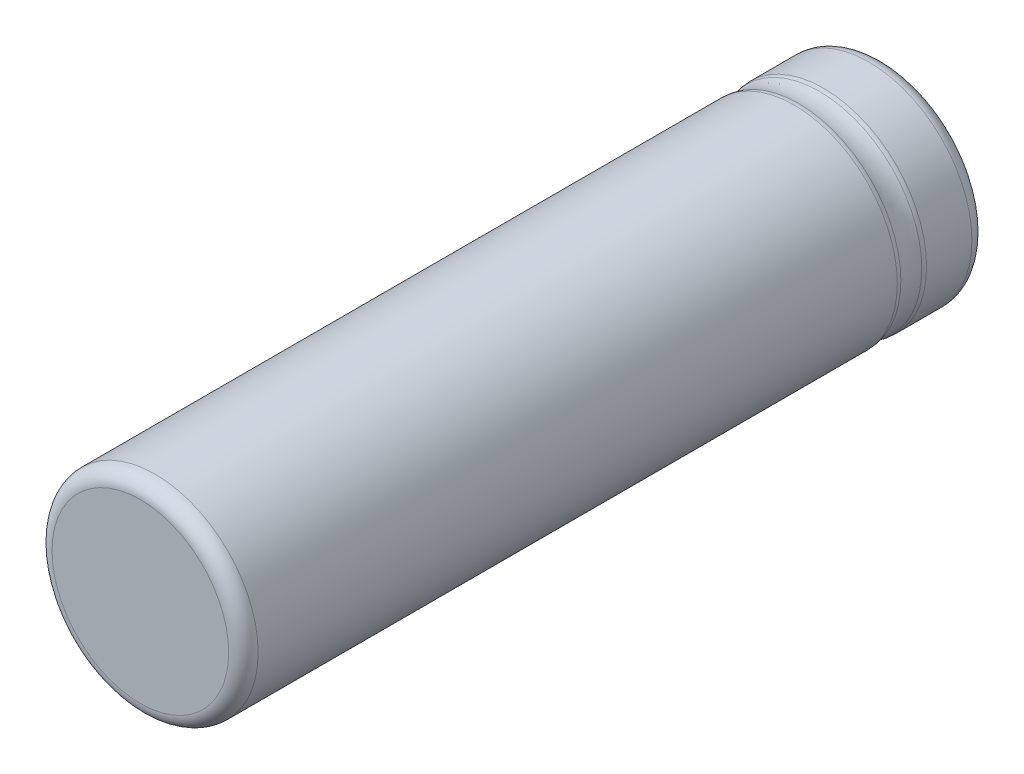
ISO-10303-21;
HEADER;
FILE_DESCRIPTION(('STEP AP214'),'2;1');
FILE_NAME('part.step','',(''),(''),'','','');
FILE_SCHEMA(('AUTOMOTIVE_DESIGN { 1 0 10303 214 1 1 1 1 }'));
ENDSEC;
DATA;
#1=APPLICATION_CONTEXT('core data for automotive mechanical design processes');
#2=APPLICATION_PROTOCOL_DEFINITION('international standard','automotive_design',2000,#1);
#3=PRODUCT_CONTEXT('',#1,'mechanical');
#4=PRODUCT('Part','Part','',(#3));
#5=PRODUCT_RELATED_PRODUCT_CATEGORY('part','',(#4));
#6=PRODUCT_DEFINITION_FORMATION('','',#4);
#7=PRODUCT_DEFINITION_CONTEXT('part definition',#1,'design');
#8=PRODUCT_DEFINITION('design','',#6,#7);
#9=PRODUCT_DEFINITION_SHAPE('','',#8);
#10=(LENGTH_UNIT() NAMED_UNIT(*) SI_UNIT(.MILLI.,.METRE.));
#11=(NAMED_UNIT(*) PLANE_ANGLE_UNIT() SI_UNIT($,.RADIAN.));
#12=(NAMED_UNIT(*) SI_UNIT($,.STERADIAN.) SOLID_ANGLE_UNIT());
#13=UNCERTAINTY_MEASURE_WITH_UNIT(LENGTH_MEASURE(1.E-05),#10,'distance_accuracy_value','');
#14=(GEOMETRIC_REPRESENTATION_CONTEXT(3) GLOBAL_UNCERTAINTY_ASSIGNED_CONTEXT((#13)) GLOBAL_UNIT_ASSIGNED_CONTEXT((#10,
#11,#12)) REPRESENTATION_CONTEXT('',''));
#15=CARTESIAN_POINT('',(0.,0.,0.));
#16=DIRECTION('',(0.,0.,1.));
#17=DIRECTION('',(1.,0.,0.));
#18=AXIS2_PLACEMENT_3D('',#15,#16,#17);
#19=CARTESIAN_POINT('',(0.,0.,50.5));
#20=DIRECTION('',(0.,0.,-1.));
#21=DIRECTION('',(-1.,0.,0.));
#22=AXIS2_PLACEMENT_3D('',#19,#20,#21);
#23=CYLINDRICAL_SURFACE('',#22,7.);
#24=CARTESIAN_POINT('',(0.,0.,1.));
#25=DIRECTION('',(0.,0.,1.));
#26=DIRECTION('',(1.,0.,0.));
#27=AXIS2_PLACEMENT_3D('',#24,#25,#26);
#28=CIRCLE('',#27,7.);
#29=CARTESIAN_POINT('',(7.,0.,1.));
#30=VERTEX_POINT('',#29);
#31=EDGE_CURVE('E55',#30,#30,#28,.T.);
#32=ORIENTED_EDGE('',*,*,#31,.T.);
#33=EDGE_LOOP('',(#32));
#34=FACE_BOUND('',#33,.T.);
#35=CARTESIAN_POINT('',(0.,0.,4.08286669280834));
#36=DIRECTION('',(0.,0.,1.));
#37=DIRECTION('',(1.,0.,0.));
#38=AXIS2_PLACEMENT_3D('',#35,#36,#37);
#39=CIRCLE('',#38,7.);
#40=CARTESIAN_POINT('',(7.,0.,4.08286669280834));
#41=VERTEX_POINT('',#40);
#42=EDGE_CURVE('E58',#41,#41,#39,.F.);
#43=ORIENTED_EDGE('',*,*,#42,.T.);
#44=EDGE_LOOP('',(#43));
#45=FACE_BOUND('',#44,.T.);
#46=ADVANCED_FACE('F29',(#34,#45),#23,.T.);
#47=CARTESIAN_POINT('',(0.,0.,0.));
#48=DIRECTION('',(0.,0.,1.));
#49=DIRECTION('',(1.,0.,0.));
#50=AXIS2_PLACEMENT_3D('',#47,#48,#49);
#51=PLANE('',#50);
#52=CARTESIAN_POINT('',(0.,0.,0.));
#53=DIRECTION('',(0.,0.,1.));
#54=DIRECTION('',(1.,0.,0.));
#55=AXIS2_PLACEMENT_3D('',#52,#53,#54);
#56=CIRCLE('',#55,6.);
#57=CARTESIAN_POINT('',(6.,0.,0.));
#58=VERTEX_POINT('',#57);
#59=EDGE_CURVE('E52',#58,#58,#56,.F.);
#60=ORIENTED_EDGE('',*,*,#59,.T.);
#61=EDGE_LOOP('',(#60));
#62=FACE_BOUND('',#61,.T.);
#63=ADVANCED_FACE('F72',(#62),#51,.F.);
#64=CARTESIAN_POINT('',(0.,0.,5.07709652065103));
#65=DIRECTION('',(0.,0.,-1.));
#66=DIRECTION('',(-1.,0.,0.));
#67=AXIS2_PLACEMENT_3D('',#64,#65,#66);
#68=TOROIDAL_SURFACE('',#67,9.35581689748233,2.5);
#69=CARTESIAN_POINT('',(0.,0.,5.7872606833958));
#70=DIRECTION('',(0.,0.,-1.));
#71=DIRECTION('',(-1.,0.,0.));
#72=AXIS2_PLACEMENT_3D('',#69,#70,#71);
#73=CIRCLE('',#72,6.9588048278521);
#74=CARTESIAN_POINT('',(-6.9588048278521,0.,5.7872606833958));
#75=VERTEX_POINT('',#74);
#76=EDGE_CURVE('E10',#75,#75,#73,.T.);
#77=ORIENTED_EDGE('',*,*,#76,.T.);
#78=EDGE_LOOP('',(#77));
#79=FACE_BOUND('',#78,.T.);
#80=CARTESIAN_POINT('',(0.,0.,4.36693235790625));
#81=DIRECTION('',(0.,0.,1.));
#82=DIRECTION('',(1.,0.,0.));
#83=AXIS2_PLACEMENT_3D('',#80,#81,#82);
#84=CIRCLE('',#83,6.9588048278521);
#85=CARTESIAN_POINT('',(6.9588048278521,0.,4.36693235790625));
#86=VERTEX_POINT('',#85);
#87=EDGE_CURVE('E36',#86,#86,#84,.T.);
#88=ORIENTED_EDGE('',*,*,#87,.T.);
#89=EDGE_LOOP('',(#88));
#90=FACE_BOUND('',#89,.T.);
#91=ADVANCED_FACE('F79',(#79,#90),#68,.F.);
#92=CARTESIAN_POINT('',(0.,0.,50.5));
#93=DIRECTION('',(0.,0.,1.));
#94=DIRECTION('',(1.,0.,0.));
#95=AXIS2_PLACEMENT_3D('',#92,#93,#94);
#96=PLANE('',#95);
#97=CARTESIAN_POINT('',(0.,0.,50.5));
#98=DIRECTION('',(0.,0.,1.));
#99=DIRECTION('',(1.,0.,0.));
#100=AXIS2_PLACEMENT_3D('',#97,#98,#99);
#101=CIRCLE('',#100,6.);
#102=CARTESIAN_POINT('',(6.,0.,50.5));
#103=VERTEX_POINT('',#102);
#104=EDGE_CURVE('E49',#103,#103,#101,.T.);
#105=ORIENTED_EDGE('',*,*,#104,.T.);
#106=EDGE_LOOP('',(#105));
#107=FACE_BOUND('',#106,.T.);
#108=ADVANCED_FACE('F85',(#107),#96,.T.);
#109=CARTESIAN_POINT('',(0.,0.,49.5));
#110=DIRECTION('',(0.,0.,1.));
#111=DIRECTION('',(1.,0.,0.));
#112=AXIS2_PLACEMENT_3D('',#109,#110,#111);
#113=CIRCLE('',#112,7.);
#114=CARTESIAN_POINT('',(7.,0.,49.5));
#115=VERTEX_POINT('',#114);
#116=EDGE_CURVE('E40',#115,#115,#113,.F.);
#117=ORIENTED_EDGE('',*,*,#116,.T.);
#118=EDGE_LOOP('',(#117));
#119=FACE_BOUND('',#118,.T.);
#120=CARTESIAN_POINT('',(0.,0.,6.07132634849371));
#121=DIRECTION('',(0.,0.,-1.));
#122=DIRECTION('',(-1.,0.,0.));
#123=AXIS2_PLACEMENT_3D('',#120,#121,#122);
#124=CIRCLE('',#123,7.);
#125=CARTESIAN_POINT('',(-7.,0.,6.07132634849371));
#126=VERTEX_POINT('',#125);
#127=EDGE_CURVE('E44',#126,#126,#124,.F.);
#128=ORIENTED_EDGE('',*,*,#127,.T.);
#129=EDGE_LOOP('',(#128));
#130=FACE_BOUND('',#129,.T.);
#131=ADVANCED_FACE('F75',(#119,#130),#23,.T.);
#132=CARTESIAN_POINT('',(0.,0.,1.));
#133=DIRECTION('',(0.,0.,1.));
#134=DIRECTION('',(1.,0.,0.));
#135=AXIS2_PLACEMENT_3D('',#132,#133,#134);
#136=TOROIDAL_SURFACE('',#135,6.,1.);
#137=ORIENTED_EDGE('',*,*,#59,.F.);
#138=EDGE_LOOP('',(#137));
#139=FACE_BOUND('',#138,.T.);
#140=ORIENTED_EDGE('',*,*,#31,.F.);
#141=EDGE_LOOP('',(#140));
#142=FACE_BOUND('',#141,.T.);
#143=ADVANCED_FACE('F84',(#139,#142),#136,.T.);
#144=CARTESIAN_POINT('',(0.,0.,49.5));
#145=DIRECTION('',(0.,0.,1.));
#146=DIRECTION('',(1.,0.,0.));
#147=AXIS2_PLACEMENT_3D('',#144,#145,#146);
#148=TOROIDAL_SURFACE('',#147,6.,1.);
#149=ORIENTED_EDGE('',*,*,#116,.F.);
#150=EDGE_LOOP('',(#149));
#151=FACE_BOUND('',#150,.T.);
#152=ORIENTED_EDGE('',*,*,#104,.F.);
#153=EDGE_LOOP('',(#152));
#154=FACE_BOUND('',#153,.T.);
#155=ADVANCED_FACE('F69',(#151,#154),#148,.T.);
#156=CARTESIAN_POINT('',(0.,0.,6.07132634849371));
#157=DIRECTION('',(0.,0.,-1.));
#158=DIRECTION('',(-1.,0.,0.));
#159=AXIS2_PLACEMENT_3D('',#156,#157,#158);
#160=TOROIDAL_SURFACE('',#159,6.,1.);
#161=ORIENTED_EDGE('',*,*,#76,.F.);
#162=EDGE_LOOP('',(#161));
#163=FACE_BOUND('',#162,.T.);
#164=ORIENTED_EDGE('',*,*,#127,.F.);
#165=EDGE_LOOP('',(#164));
#166=FACE_BOUND('',#165,.T.);
#167=ADVANCED_FACE('F64',(#163,#166),#160,.T.);
#168=CARTESIAN_POINT('',(0.,0.,4.08286669280834));
#169=DIRECTION('',(0.,0.,1.));
#170=DIRECTION('',(1.,0.,0.));
#171=AXIS2_PLACEMENT_3D('',#168,#169,#170);
#172=TOROIDAL_SURFACE('',#171,6.,1.);
#173=ORIENTED_EDGE('',*,*,#87,.F.);
#174=EDGE_LOOP('',(#173));
#175=FACE_BOUND('',#174,.T.);
#176=ORIENTED_EDGE('',*,*,#42,.F.);
#177=EDGE_LOOP('',(#176));
#178=FACE_BOUND('',#177,.T.);
#179=ADVANCED_FACE('F31',(#175,#178),#172,.T.);
#180=CLOSED_SHELL('',(#46,#63,#91,#108,#131,#143,#155,#167,#179));
#181=MANIFOLD_SOLID_BREP('B2',#180);
#182=ADVANCED_BREP_SHAPE_REPRESENTATION('',(#18,#181),#14);
#183=SHAPE_DEFINITION_REPRESENTATION(#9,#182);
ENDSEC;
END-ISO-10303-21;
